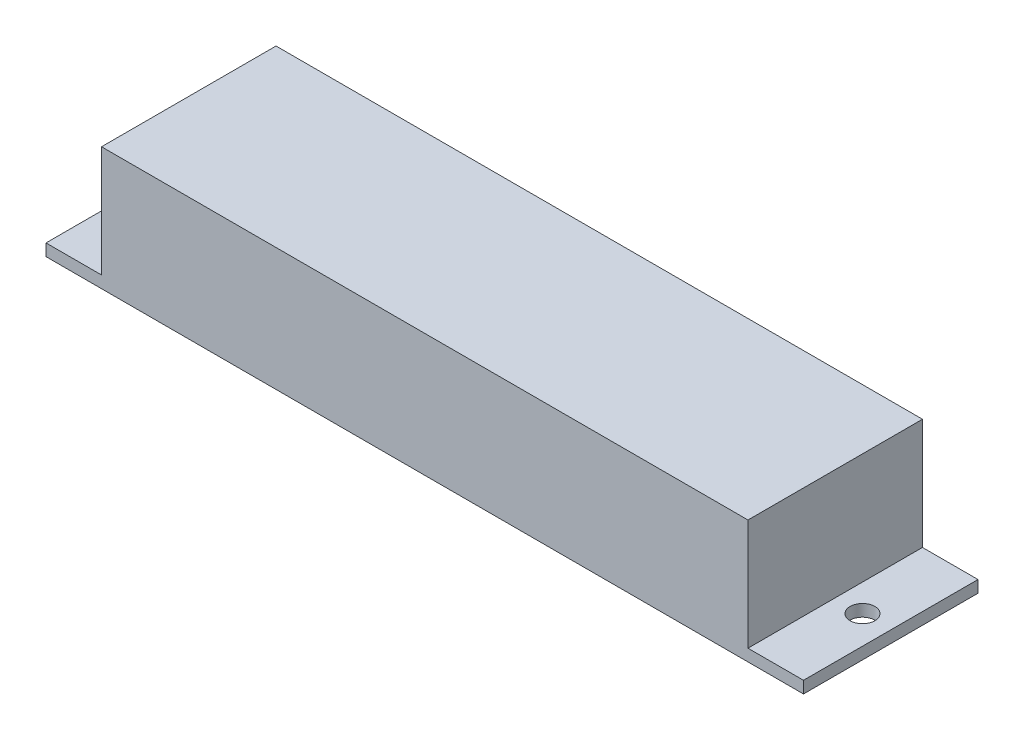
ISO-10303-21;
HEADER;
FILE_DESCRIPTION(('STEP AP214'),'2;1');
FILE_NAME('part.step','',(''),(''),'','','');
FILE_SCHEMA(('AUTOMOTIVE_DESIGN { 1 0 10303 214 1 1 1 1 }'));
ENDSEC;
DATA;
#1=APPLICATION_CONTEXT('core data for automotive mechanical design processes');
#2=APPLICATION_PROTOCOL_DEFINITION('international standard','automotive_design',2000,#1);
#3=PRODUCT_CONTEXT('',#1,'mechanical');
#4=PRODUCT('Part','Part','',(#3));
#5=PRODUCT_RELATED_PRODUCT_CATEGORY('part','',(#4));
#6=PRODUCT_DEFINITION_FORMATION('','',#4);
#7=PRODUCT_DEFINITION_CONTEXT('part definition',#1,'design');
#8=PRODUCT_DEFINITION('design','',#6,#7);
#9=PRODUCT_DEFINITION_SHAPE('','',#8);
#10=(LENGTH_UNIT() NAMED_UNIT(*) SI_UNIT(.MILLI.,.METRE.));
#11=(NAMED_UNIT(*) PLANE_ANGLE_UNIT() SI_UNIT($,.RADIAN.));
#12=(NAMED_UNIT(*) SI_UNIT($,.STERADIAN.) SOLID_ANGLE_UNIT());
#13=UNCERTAINTY_MEASURE_WITH_UNIT(LENGTH_MEASURE(1.E-05),#10,'distance_accuracy_value','');
#14=(GEOMETRIC_REPRESENTATION_CONTEXT(3) GLOBAL_UNCERTAINTY_ASSIGNED_CONTEXT((#13)) GLOBAL_UNIT_ASSIGNED_CONTEXT((#10,
#11,#12)) REPRESENTATION_CONTEXT('',''));
#15=CARTESIAN_POINT('',(0.,0.,0.));
#16=DIRECTION('',(0.,0.,1.));
#17=DIRECTION('',(1.,0.,0.));
#18=AXIS2_PLACEMENT_3D('',#15,#16,#17);
#19=CARTESIAN_POINT('',(0.,1.524,0.));
#20=DIRECTION('',(0.,-1.,0.));
#21=DIRECTION('',(0.,0.,-1.));
#22=AXIS2_PLACEMENT_3D('',#19,#20,#21);
#23=PLANE('',#22);
#24=CARTESIAN_POINT('',(-22.0893937728938,1.524,0.));
#25=DIRECTION('',(0.,1.,0.));
#26=DIRECTION('',(0.,0.,1.));
#27=AXIS2_PLACEMENT_3D('',#24,#25,#26);
#28=CIRCLE('',#27,1.5875);
#29=CARTESIAN_POINT('',(-22.0893937728938,1.524,1.5875));
#30=VERTEX_POINT('',#29);
#31=EDGE_CURVE('E176',#30,#30,#28,.T.);
#32=ORIENTED_EDGE('',*,*,#31,.F.);
#33=EDGE_LOOP('',(#32));
#34=FACE_BOUND('',#33,.T.);
#35=DIRECTION('',(0.,0.,1.));
#36=VECTOR('',#35,1.);
#37=CARTESIAN_POINT('',(-18.5968937728938,1.524,0.));
#38=LINE('',#37,#36);
#39=CARTESIAN_POINT('',(-18.5968937728938,1.524,-11.176));
#40=VERTEX_POINT('',#39);
#41=CARTESIAN_POINT('',(-18.5968937728938,1.524,11.176));
#42=VERTEX_POINT('',#41);
#43=EDGE_CURVE('E173',#40,#42,#38,.T.);
#44=ORIENTED_EDGE('',*,*,#43,.F.);
#45=DIRECTION('',(1.,0.,0.));
#46=VECTOR('',#45,1.);
#47=CARTESIAN_POINT('',(-25.7088937728938,1.524,-11.176));
#48=LINE('',#47,#46);
#49=CARTESIAN_POINT('',(-25.7088937728938,1.524,-11.176));
#50=VERTEX_POINT('',#49);
#51=EDGE_CURVE('E148',#50,#40,#48,.T.);
#52=ORIENTED_EDGE('',*,*,#51,.F.);
#53=DIRECTION('',(0.,0.,1.));
#54=VECTOR('',#53,1.);
#55=CARTESIAN_POINT('',(-25.7088937728938,1.524,-11.176));
#56=LINE('',#55,#54);
#57=CARTESIAN_POINT('',(-25.7088937728938,1.524,11.176));
#58=VERTEX_POINT('',#57);
#59=EDGE_CURVE('E196',#50,#58,#56,.T.);
#60=ORIENTED_EDGE('',*,*,#59,.T.);
#61=DIRECTION('',(1.,0.,0.));
#62=VECTOR('',#61,1.);
#63=CARTESIAN_POINT('',(-25.7088937728938,1.524,11.176));
#64=LINE('',#63,#62);
#65=EDGE_CURVE('E193',#58,#42,#64,.T.);
#66=ORIENTED_EDGE('',*,*,#65,.T.);
#67=EDGE_LOOP('',(#44,#52,#60,#66));
#68=FACE_BOUND('',#67,.T.);
#69=ADVANCED_FACE('F70',(#34,#68),#23,.F.);
#70=CARTESIAN_POINT('',(67.6996062271062,1.524,0.));
#71=DIRECTION('',(0.,-1.,0.));
#72=DIRECTION('',(0.,0.,-1.));
#73=AXIS2_PLACEMENT_3D('',#70,#71,#72);
#74=CIRCLE('',#73,1.5875);
#75=CARTESIAN_POINT('',(67.6996062271062,1.524,-1.5875));
#76=VERTEX_POINT('',#75);
#77=EDGE_CURVE('E182',#76,#76,#74,.T.);
#78=ORIENTED_EDGE('',*,*,#77,.T.);
#79=EDGE_LOOP('',(#78));
#80=FACE_BOUND('',#79,.T.);
#81=CARTESIAN_POINT('',(64.2071062271062,1.524,-11.176));
#82=VERTEX_POINT('',#81);
#83=CARTESIAN_POINT('',(71.3191062271062,1.524,-11.176));
#84=VERTEX_POINT('',#83);
#85=EDGE_CURVE('E119',#82,#84,#48,.T.);
#86=ORIENTED_EDGE('',*,*,#85,.F.);
#87=DIRECTION('',(0.,0.,1.));
#88=VECTOR('',#87,1.);
#89=CARTESIAN_POINT('',(64.2071062271062,1.524,0.));
#90=LINE('',#89,#88);
#91=CARTESIAN_POINT('',(64.2071062271062,1.524,11.176));
#92=VERTEX_POINT('',#91);
#93=EDGE_CURVE('E151',#82,#92,#90,.T.);
#94=ORIENTED_EDGE('',*,*,#93,.T.);
#95=CARTESIAN_POINT('',(71.3191062271062,1.524,11.176));
#96=VERTEX_POINT('',#95);
#97=EDGE_CURVE('E192',#92,#96,#64,.T.);
#98=ORIENTED_EDGE('',*,*,#97,.T.);
#99=DIRECTION('',(0.,0.,1.));
#100=VECTOR('',#99,1.);
#101=CARTESIAN_POINT('',(71.3191062271062,1.524,-11.176));
#102=LINE('',#101,#100);
#103=EDGE_CURVE('E189',#84,#96,#102,.T.);
#104=ORIENTED_EDGE('',*,*,#103,.F.);
#105=EDGE_LOOP('',(#86,#94,#98,#104));
#106=FACE_BOUND('',#105,.T.);
#107=ADVANCED_FACE('F226',(#80,#106),#23,.F.);
#108=CARTESIAN_POINT('',(0.,0.,0.));
#109=DIRECTION('',(0.,-1.,0.));
#110=DIRECTION('',(0.,0.,-1.));
#111=AXIS2_PLACEMENT_3D('',#108,#109,#110);
#112=PLANE('',#111);
#113=DIRECTION('',(0.,0.,1.));
#114=VECTOR('',#113,1.);
#115=CARTESIAN_POINT('',(71.3191062271062,0.,-11.176));
#116=LINE('',#115,#114);
#117=CARTESIAN_POINT('',(71.3191062271062,0.,-11.176));
#118=VERTEX_POINT('',#117);
#119=CARTESIAN_POINT('',(71.3191062271062,0.,11.176));
#120=VERTEX_POINT('',#119);
#121=EDGE_CURVE('E199',#118,#120,#116,.T.);
#122=ORIENTED_EDGE('',*,*,#121,.T.);
#123=DIRECTION('',(1.,0.,0.));
#124=VECTOR('',#123,1.);
#125=CARTESIAN_POINT('',(-25.7088937728938,0.,11.176));
#126=LINE('',#125,#124);
#127=CARTESIAN_POINT('',(-25.7088937728938,0.,11.176));
#128=VERTEX_POINT('',#127);
#129=EDGE_CURVE('E202',#128,#120,#126,.T.);
#130=ORIENTED_EDGE('',*,*,#129,.F.);
#131=DIRECTION('',(0.,0.,1.));
#132=VECTOR('',#131,1.);
#133=CARTESIAN_POINT('',(-25.7088937728938,0.,-11.176));
#134=LINE('',#133,#132);
#135=CARTESIAN_POINT('',(-25.7088937728938,0.,-11.176));
#136=VERTEX_POINT('',#135);
#137=EDGE_CURVE('E204',#136,#128,#134,.T.);
#138=ORIENTED_EDGE('',*,*,#137,.F.);
#139=DIRECTION('',(1.,0.,0.));
#140=VECTOR('',#139,1.);
#141=CARTESIAN_POINT('',(-25.7088937728938,0.,-11.176));
#142=LINE('',#141,#140);
#143=EDGE_CURVE('E185',#136,#118,#142,.T.);
#144=ORIENTED_EDGE('',*,*,#143,.T.);
#145=EDGE_LOOP('',(#122,#130,#138,#144));
#146=FACE_BOUND('',#145,.T.);
#147=CARTESIAN_POINT('',(67.6996062271062,0.,0.));
#148=DIRECTION('',(0.,-1.,0.));
#149=DIRECTION('',(0.,0.,-1.));
#150=AXIS2_PLACEMENT_3D('',#147,#148,#149);
#151=CIRCLE('',#150,1.5875);
#152=CARTESIAN_POINT('',(67.6996062271062,0.,-1.5875));
#153=VERTEX_POINT('',#152);
#154=EDGE_CURVE('E179',#153,#153,#151,.T.);
#155=ORIENTED_EDGE('',*,*,#154,.F.);
#156=EDGE_LOOP('',(#155));
#157=FACE_BOUND('',#156,.T.);
#158=CARTESIAN_POINT('',(-22.0893937728938,0.,0.));
#159=DIRECTION('',(0.,1.,0.));
#160=DIRECTION('',(0.,0.,1.));
#161=AXIS2_PLACEMENT_3D('',#158,#159,#160);
#162=CIRCLE('',#161,1.5875);
#163=CARTESIAN_POINT('',(-22.0893937728938,0.,1.5875));
#164=VERTEX_POINT('',#163);
#165=EDGE_CURVE('E175',#164,#164,#162,.T.);
#166=ORIENTED_EDGE('',*,*,#165,.T.);
#167=EDGE_LOOP('',(#166));
#168=FACE_BOUND('',#167,.T.);
#169=ADVANCED_FACE('F216',(#146,#157,#168),#112,.T.);
#170=CARTESIAN_POINT('',(-25.7088937728938,1.524,-11.176));
#171=DIRECTION('',(0.,0.,-1.));
#172=DIRECTION('',(-1.,0.,0.));
#173=AXIS2_PLACEMENT_3D('',#170,#171,#172);
#174=PLANE('',#173);
#175=DIRECTION('',(0.,-1.,0.));
#176=VECTOR('',#175,1.);
#177=CARTESIAN_POINT('',(71.3191062271062,1.524,-11.176));
#178=LINE('',#177,#176);
#179=EDGE_CURVE('E74',#84,#118,#178,.T.);
#180=ORIENTED_EDGE('',*,*,#179,.T.);
#181=ORIENTED_EDGE('',*,*,#143,.F.);
#182=DIRECTION('',(0.,-1.,0.));
#183=VECTOR('',#182,1.);
#184=CARTESIAN_POINT('',(-25.7088937728938,1.524,-11.176));
#185=LINE('',#184,#183);
#186=EDGE_CURVE('E12',#50,#136,#185,.T.);
#187=ORIENTED_EDGE('',*,*,#186,.F.);
#188=ORIENTED_EDGE('',*,*,#51,.T.);
#189=DIRECTION('',(0.,-1.,0.));
#190=VECTOR('',#189,1.);
#191=CARTESIAN_POINT('',(-18.5968937728938,15.748,-11.176));
#192=LINE('',#191,#190);
#193=CARTESIAN_POINT('',(-18.5968937728938,15.748,-11.176));
#194=VERTEX_POINT('',#193);
#195=EDGE_CURVE('E142',#194,#40,#192,.T.);
#196=ORIENTED_EDGE('',*,*,#195,.F.);
#197=DIRECTION('',(1.,0.,0.));
#198=VECTOR('',#197,1.);
#199=CARTESIAN_POINT('',(0.,15.748,-11.176));
#200=LINE('',#199,#198);
#201=CARTESIAN_POINT('',(64.2071062271062,15.748,-11.176));
#202=VERTEX_POINT('',#201);
#203=EDGE_CURVE('E145',#194,#202,#200,.T.);
#204=ORIENTED_EDGE('',*,*,#203,.T.);
#205=DIRECTION('',(0.,-1.,0.));
#206=VECTOR('',#205,1.);
#207=CARTESIAN_POINT('',(64.2071062271062,15.748,-11.176));
#208=LINE('',#207,#206);
#209=EDGE_CURVE('E168',#202,#82,#208,.T.);
#210=ORIENTED_EDGE('',*,*,#209,.T.);
#211=ORIENTED_EDGE('',*,*,#85,.T.);
#212=EDGE_LOOP('',(#180,#181,#187,#188,#196,#204,#210,#211));
#213=FACE_BOUND('',#212,.T.);
#214=ADVANCED_FACE('F72',(#213),#174,.T.);
#215=CARTESIAN_POINT('',(-25.7088937728938,1.524,-11.176));
#216=DIRECTION('',(1.,0.,0.));
#217=DIRECTION('',(0.,0.,-1.));
#218=AXIS2_PLACEMENT_3D('',#215,#216,#217);
#219=PLANE('',#218);
#220=ORIENTED_EDGE('',*,*,#137,.T.);
#221=DIRECTION('',(0.,-1.,0.));
#222=VECTOR('',#221,1.);
#223=CARTESIAN_POINT('',(-25.7088937728938,1.524,11.176));
#224=LINE('',#223,#222);
#225=EDGE_CURVE('E79',#58,#128,#224,.T.);
#226=ORIENTED_EDGE('',*,*,#225,.F.);
#227=ORIENTED_EDGE('',*,*,#59,.F.);
#228=ORIENTED_EDGE('',*,*,#186,.T.);
#229=EDGE_LOOP('',(#220,#226,#227,#228));
#230=FACE_BOUND('',#229,.T.);
#231=ADVANCED_FACE('F219',(#230),#219,.F.);
#232=CARTESIAN_POINT('',(-25.7088937728938,1.524,11.176));
#233=DIRECTION('',(0.,0.,-1.));
#234=DIRECTION('',(-1.,0.,0.));
#235=AXIS2_PLACEMENT_3D('',#232,#233,#234);
#236=PLANE('',#235);
#237=ORIENTED_EDGE('',*,*,#97,.F.);
#238=DIRECTION('',(0.,-1.,0.));
#239=VECTOR('',#238,1.);
#240=CARTESIAN_POINT('',(64.2071062271062,15.748,11.176));
#241=LINE('',#240,#239);
#242=CARTESIAN_POINT('',(64.2071062271062,15.748,11.176));
#243=VERTEX_POINT('',#242);
#244=EDGE_CURVE('E87',#243,#92,#241,.T.);
#245=ORIENTED_EDGE('',*,*,#244,.F.);
#246=DIRECTION('',(1.,0.,0.));
#247=VECTOR('',#246,1.);
#248=CARTESIAN_POINT('',(0.,15.748,11.176));
#249=LINE('',#248,#247);
#250=CARTESIAN_POINT('',(-18.5968937728938,15.748,11.176));
#251=VERTEX_POINT('',#250);
#252=EDGE_CURVE('E160',#251,#243,#249,.T.);
#253=ORIENTED_EDGE('',*,*,#252,.F.);
#254=DIRECTION('',(0.,-1.,0.));
#255=VECTOR('',#254,1.);
#256=CARTESIAN_POINT('',(-18.5968937728938,15.748,11.176));
#257=LINE('',#256,#255);
#258=EDGE_CURVE('E152',#251,#42,#257,.T.);
#259=ORIENTED_EDGE('',*,*,#258,.T.);
#260=ORIENTED_EDGE('',*,*,#65,.F.);
#261=ORIENTED_EDGE('',*,*,#225,.T.);
#262=ORIENTED_EDGE('',*,*,#129,.T.);
#263=DIRECTION('',(0.,-1.,0.));
#264=VECTOR('',#263,1.);
#265=CARTESIAN_POINT('',(71.3191062271062,1.524,11.176));
#266=LINE('',#265,#264);
#267=EDGE_CURVE('E207',#96,#120,#266,.T.);
#268=ORIENTED_EDGE('',*,*,#267,.F.);
#269=EDGE_LOOP('',(#237,#245,#253,#259,#260,#261,#262,#268));
#270=FACE_BOUND('',#269,.T.);
#271=ADVANCED_FACE('F223',(#270),#236,.F.);
#272=CARTESIAN_POINT('',(71.3191062271062,1.524,-11.176));
#273=DIRECTION('',(1.,0.,0.));
#274=DIRECTION('',(0.,0.,-1.));
#275=AXIS2_PLACEMENT_3D('',#272,#273,#274);
#276=PLANE('',#275);
#277=ORIENTED_EDGE('',*,*,#121,.F.);
#278=ORIENTED_EDGE('',*,*,#179,.F.);
#279=ORIENTED_EDGE('',*,*,#103,.T.);
#280=ORIENTED_EDGE('',*,*,#267,.T.);
#281=EDGE_LOOP('',(#277,#278,#279,#280));
#282=FACE_BOUND('',#281,.T.);
#283=ADVANCED_FACE('F213',(#282),#276,.T.);
#284=CARTESIAN_POINT('',(67.6996062271062,1.524,0.));
#285=DIRECTION('',(0.,-1.,0.));
#286=DIRECTION('',(0.,0.,-1.));
#287=AXIS2_PLACEMENT_3D('',#284,#285,#286);
#288=CYLINDRICAL_SURFACE('',#287,1.5875);
#289=ORIENTED_EDGE('',*,*,#77,.F.);
#290=EDGE_LOOP('',(#289));
#291=FACE_BOUND('',#290,.T.);
#292=ORIENTED_EDGE('',*,*,#154,.T.);
#293=EDGE_LOOP('',(#292));
#294=FACE_BOUND('',#293,.T.);
#295=ADVANCED_FACE('F237',(#291,#294),#288,.F.);
#296=CARTESIAN_POINT('',(-22.0893937728938,1.524,0.));
#297=DIRECTION('',(0.,-1.,0.));
#298=DIRECTION('',(0.,0.,-1.));
#299=AXIS2_PLACEMENT_3D('',#296,#297,#298);
#300=CYLINDRICAL_SURFACE('',#299,1.5875);
#301=ORIENTED_EDGE('',*,*,#31,.T.);
#302=EDGE_LOOP('',(#301));
#303=FACE_BOUND('',#302,.T.);
#304=ORIENTED_EDGE('',*,*,#165,.F.);
#305=EDGE_LOOP('',(#304));
#306=FACE_BOUND('',#305,.T.);
#307=ADVANCED_FACE('F248',(#303,#306),#300,.F.);
#308=CARTESIAN_POINT('',(-18.5968937728938,15.748,0.));
#309=DIRECTION('',(1.,0.,0.));
#310=DIRECTION('',(0.,0.,-1.));
#311=AXIS2_PLACEMENT_3D('',#308,#309,#310);
#312=PLANE('',#311);
#313=ORIENTED_EDGE('',*,*,#195,.T.);
#314=ORIENTED_EDGE('',*,*,#43,.T.);
#315=ORIENTED_EDGE('',*,*,#258,.F.);
#316=DIRECTION('',(0.,0.,1.));
#317=VECTOR('',#316,1.);
#318=CARTESIAN_POINT('',(-18.5968937728938,15.748,0.));
#319=LINE('',#318,#317);
#320=EDGE_CURVE('E155',#194,#251,#319,.T.);
#321=ORIENTED_EDGE('',*,*,#320,.F.);
#322=EDGE_LOOP('',(#313,#314,#315,#321));
#323=FACE_BOUND('',#322,.T.);
#324=ADVANCED_FACE('F156',(#323),#312,.F.);
#325=CARTESIAN_POINT('',(64.2071062271062,15.748,0.));
#326=DIRECTION('',(1.,0.,0.));
#327=DIRECTION('',(0.,0.,-1.));
#328=AXIS2_PLACEMENT_3D('',#325,#326,#327);
#329=PLANE('',#328);
#330=ORIENTED_EDGE('',*,*,#93,.F.);
#331=ORIENTED_EDGE('',*,*,#209,.F.);
#332=DIRECTION('',(0.,0.,1.));
#333=VECTOR('',#332,1.);
#334=CARTESIAN_POINT('',(64.2071062271062,15.748,0.));
#335=LINE('',#334,#333);
#336=EDGE_CURVE('E163',#202,#243,#335,.T.);
#337=ORIENTED_EDGE('',*,*,#336,.T.);
#338=ORIENTED_EDGE('',*,*,#244,.T.);
#339=EDGE_LOOP('',(#330,#331,#337,#338));
#340=FACE_BOUND('',#339,.T.);
#341=ADVANCED_FACE('F260',(#340),#329,.T.);
#342=CARTESIAN_POINT('',(0.,15.748,0.));
#343=DIRECTION('',(0.,1.,0.));
#344=DIRECTION('',(0.,0.,1.));
#345=AXIS2_PLACEMENT_3D('',#342,#343,#344);
#346=PLANE('',#345);
#347=ORIENTED_EDGE('',*,*,#203,.F.);
#348=ORIENTED_EDGE('',*,*,#320,.T.);
#349=ORIENTED_EDGE('',*,*,#252,.T.);
#350=ORIENTED_EDGE('',*,*,#336,.F.);
#351=EDGE_LOOP('',(#347,#348,#349,#350));
#352=FACE_BOUND('',#351,.T.);
#353=ADVANCED_FACE('F162',(#352),#346,.T.);
#354=CLOSED_SHELL('',(#69,#107,#169,#214,#231,#271,#283,#295,#307,#324,#341,#353));
#355=MANIFOLD_SOLID_BREP('B2',#354);
#356=ADVANCED_BREP_SHAPE_REPRESENTATION('',(#18,#355),#14);
#357=SHAPE_DEFINITION_REPRESENTATION(#9,#356);
ENDSEC;
END-ISO-10303-21;
